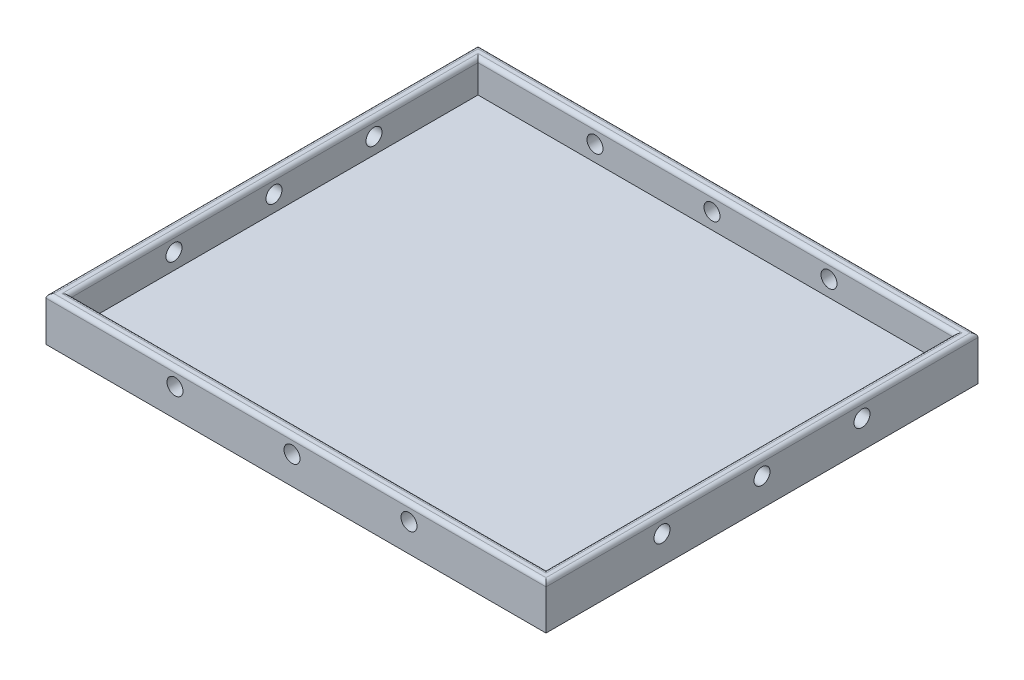
ISO-10303-21;
HEADER;
FILE_DESCRIPTION(('STEP AP214'),'2;1');
FILE_NAME('part.step','',(''),(''),'','','');
FILE_SCHEMA(('AUTOMOTIVE_DESIGN { 1 0 10303 214 1 1 1 1 }'));
ENDSEC;
DATA;
#1=APPLICATION_CONTEXT('core data for automotive mechanical design processes');
#2=APPLICATION_PROTOCOL_DEFINITION('international standard','automotive_design',2000,#1);
#3=PRODUCT_CONTEXT('',#1,'mechanical');
#4=PRODUCT('Part','Part','',(#3));
#5=PRODUCT_RELATED_PRODUCT_CATEGORY('part','',(#4));
#6=PRODUCT_DEFINITION_FORMATION('','',#4);
#7=PRODUCT_DEFINITION_CONTEXT('part definition',#1,'design');
#8=PRODUCT_DEFINITION('design','',#6,#7);
#9=PRODUCT_DEFINITION_SHAPE('','',#8);
#10=(LENGTH_UNIT() NAMED_UNIT(*) SI_UNIT(.MILLI.,.METRE.));
#11=(NAMED_UNIT(*) PLANE_ANGLE_UNIT() SI_UNIT($,.RADIAN.));
#12=(NAMED_UNIT(*) SI_UNIT($,.STERADIAN.) SOLID_ANGLE_UNIT());
#13=UNCERTAINTY_MEASURE_WITH_UNIT(LENGTH_MEASURE(1.E-05),#10,'distance_accuracy_value','');
#14=(GEOMETRIC_REPRESENTATION_CONTEXT(3) GLOBAL_UNCERTAINTY_ASSIGNED_CONTEXT((#13)) GLOBAL_UNIT_ASSIGNED_CONTEXT((#10,
#11,#12)) REPRESENTATION_CONTEXT('',''));
#15=CARTESIAN_POINT('',(0.,0.,0.));
#16=DIRECTION('',(0.,0.,1.));
#17=DIRECTION('',(1.,0.,0.));
#18=AXIS2_PLACEMENT_3D('',#15,#16,#17);
#19=CARTESIAN_POINT('',(-201.609907120743,11.,-77.8947368421052));
#20=DIRECTION('',(1.,0.,0.));
#21=DIRECTION('',(0.,0.,-1.));
#22=AXIS2_PLACEMENT_3D('',#19,#20,#21);
#23=PLANE('',#22);
#24=CARTESIAN_POINT('',(-201.609907120743,6.99999995326219,1.10526315789476));
#25=DIRECTION('',(1.,0.,0.));
#26=DIRECTION('',(0.,0.,-1.));
#27=AXIS2_PLACEMENT_3D('',#24,#25,#26);
#28=CIRCLE('',#27,2.);
#29=CARTESIAN_POINT('',(-201.609907120743,6.99999995326219,-0.894736842105239));
#30=VERTEX_POINT('',#29);
#31=EDGE_CURVE('E190',#30,#30,#28,.T.);
#32=ORIENTED_EDGE('',*,*,#31,.T.);
#33=EDGE_LOOP('',(#32));
#34=FACE_BOUND('',#33,.T.);
#35=CARTESIAN_POINT('',(-201.609907120743,6.99999997663109,-23.8947368421052));
#36=DIRECTION('',(1.,0.,0.));
#37=DIRECTION('',(0.,0.,-1.));
#38=AXIS2_PLACEMENT_3D('',#35,#36,#37);
#39=CIRCLE('',#38,2.);
#40=CARTESIAN_POINT('',(-201.609907120743,6.99999997663109,-25.8947368421052));
#41=VERTEX_POINT('',#40);
#42=EDGE_CURVE('E593',#41,#41,#39,.T.);
#43=ORIENTED_EDGE('',*,*,#42,.T.);
#44=EDGE_LOOP('',(#43));
#45=FACE_BOUND('',#44,.T.);
#46=CARTESIAN_POINT('',(-201.609907120743,7.,-48.8947368421052));
#47=DIRECTION('',(1.,0.,0.));
#48=DIRECTION('',(0.,0.,-1.));
#49=AXIS2_PLACEMENT_3D('',#46,#47,#48);
#50=CIRCLE('',#49,2.);
#51=CARTESIAN_POINT('',(-201.609907120743,7.,-50.8947368421052));
#52=VERTEX_POINT('',#51);
#53=EDGE_CURVE('E586',#52,#52,#50,.T.);
#54=ORIENTED_EDGE('',*,*,#53,.T.);
#55=EDGE_LOOP('',(#54));
#56=FACE_BOUND('',#55,.T.);
#57=DIRECTION('',(0.,-1.,0.));
#58=VECTOR('',#57,1.);
#59=CARTESIAN_POINT('',(-201.609907120743,11.,30.1052631578948));
#60=LINE('',#59,#58);
#61=CARTESIAN_POINT('',(-201.609907120743,10.,30.1052631578948));
#62=VERTEX_POINT('',#61);
#63=CARTESIAN_POINT('',(-201.609907120743,0.,30.1052631578948));
#64=VERTEX_POINT('',#63);
#65=EDGE_CURVE('E183',#62,#64,#60,.T.);
#66=ORIENTED_EDGE('',*,*,#65,.F.);
#67=DIRECTION('',(0.,0.,1.));
#68=VECTOR('',#67,1.);
#69=CARTESIAN_POINT('',(-201.609907120743,10.,-77.8947368421052));
#70=LINE('',#69,#68);
#71=CARTESIAN_POINT('',(-201.609907120743,10.,-77.8947368421052));
#72=VERTEX_POINT('',#71);
#73=EDGE_CURVE('E44',#62,#72,#70,.F.);
#74=ORIENTED_EDGE('',*,*,#73,.T.);
#75=DIRECTION('',(0.,-1.,0.));
#76=VECTOR('',#75,1.);
#77=CARTESIAN_POINT('',(-201.609907120743,11.,-77.8947368421052));
#78=LINE('',#77,#76);
#79=CARTESIAN_POINT('',(-201.609907120743,0.,-77.8947368421052));
#80=VERTEX_POINT('',#79);
#81=EDGE_CURVE('E177',#72,#80,#78,.T.);
#82=ORIENTED_EDGE('',*,*,#81,.T.);
#83=DIRECTION('',(0.,0.,1.));
#84=VECTOR('',#83,1.);
#85=CARTESIAN_POINT('',(-201.609907120743,0.,-77.8947368421052));
#86=LINE('',#85,#84);
#87=EDGE_CURVE('E162',#80,#64,#86,.T.);
#88=ORIENTED_EDGE('',*,*,#87,.T.);
#89=EDGE_LOOP('',(#66,#74,#82,#88));
#90=FACE_BOUND('',#89,.T.);
#91=ADVANCED_FACE('F35',(#34,#45,#56,#90),#23,.F.);
#92=CARTESIAN_POINT('',(-201.609907120743,11.,30.1052631578948));
#93=DIRECTION('',(0.,0.,-1.));
#94=DIRECTION('',(-1.,0.,0.));
#95=AXIS2_PLACEMENT_3D('',#92,#93,#94);
#96=PLANE('',#95);
#97=CARTESIAN_POINT('',(-169.359907120743,7.,30.1052631578948));
#98=DIRECTION('',(0.,0.,1.));
#99=DIRECTION('',(1.,0.,0.));
#100=AXIS2_PLACEMENT_3D('',#97,#98,#99);
#101=CIRCLE('',#100,2.);
#102=CARTESIAN_POINT('',(-167.359907120743,7.,30.1052631578948));
#103=VERTEX_POINT('',#102);
#104=EDGE_CURVE('E621',#103,#103,#101,.T.);
#105=ORIENTED_EDGE('',*,*,#104,.F.);
#106=EDGE_LOOP('',(#105));
#107=FACE_BOUND('',#106,.T.);
#108=CARTESIAN_POINT('',(-140.109907120743,7.,30.1052631578948));
#109=DIRECTION('',(0.,0.,1.));
#110=DIRECTION('',(1.,0.,0.));
#111=AXIS2_PLACEMENT_3D('',#108,#109,#110);
#112=CIRCLE('',#111,2.);
#113=CARTESIAN_POINT('',(-138.109907120743,7.,30.1052631578948));
#114=VERTEX_POINT('',#113);
#115=EDGE_CURVE('E615',#114,#114,#112,.T.);
#116=ORIENTED_EDGE('',*,*,#115,.F.);
#117=EDGE_LOOP('',(#116));
#118=FACE_BOUND('',#117,.T.);
#119=CARTESIAN_POINT('',(-110.859907120743,7.,30.1052631578948));
#120=DIRECTION('',(0.,0.,1.));
#121=DIRECTION('',(1.,0.,0.));
#122=AXIS2_PLACEMENT_3D('',#119,#120,#121);
#123=CIRCLE('',#122,2.);
#124=CARTESIAN_POINT('',(-108.859907120743,7.,30.1052631578948));
#125=VERTEX_POINT('',#124);
#126=EDGE_CURVE('E249',#125,#125,#123,.T.);
#127=ORIENTED_EDGE('',*,*,#126,.F.);
#128=EDGE_LOOP('',(#127));
#129=FACE_BOUND('',#128,.T.);
#130=DIRECTION('',(0.,-1.,0.));
#131=VECTOR('',#130,1.);
#132=CARTESIAN_POINT('',(-76.6099071207431,11.,30.1052631578948));
#133=LINE('',#132,#131);
#134=CARTESIAN_POINT('',(-76.6099071207431,10.,30.1052631578948));
#135=VERTEX_POINT('',#134);
#136=CARTESIAN_POINT('',(-76.6099071207431,0.,30.1052631578948));
#137=VERTEX_POINT('',#136);
#138=EDGE_CURVE('E181',#135,#137,#133,.T.);
#139=ORIENTED_EDGE('',*,*,#138,.F.);
#140=DIRECTION('',(1.,0.,0.));
#141=VECTOR('',#140,1.);
#142=CARTESIAN_POINT('',(-201.609907120743,10.,30.1052631578948));
#143=LINE('',#142,#141);
#144=EDGE_CURVE('E229',#135,#62,#143,.F.);
#145=ORIENTED_EDGE('',*,*,#144,.T.);
#146=ORIENTED_EDGE('',*,*,#65,.T.);
#147=DIRECTION('',(1.,0.,0.));
#148=VECTOR('',#147,1.);
#149=CARTESIAN_POINT('',(-201.609907120743,0.,30.1052631578948));
#150=LINE('',#149,#148);
#151=EDGE_CURVE('E168',#64,#137,#150,.T.);
#152=ORIENTED_EDGE('',*,*,#151,.T.);
#153=EDGE_LOOP('',(#139,#145,#146,#152));
#154=FACE_BOUND('',#153,.T.);
#155=ADVANCED_FACE('F281',(#107,#118,#129,#154),#96,.F.);
#156=CARTESIAN_POINT('',(-76.6099071207431,11.,-77.8947368421052));
#157=DIRECTION('',(-1.,0.,0.));
#158=DIRECTION('',(0.,0.,1.));
#159=AXIS2_PLACEMENT_3D('',#156,#157,#158);
#160=PLANE('',#159);
#161=CARTESIAN_POINT('',(-76.6099071207431,6.99999995326219,1.10526315789476));
#162=DIRECTION('',(1.,0.,0.));
#163=DIRECTION('',(0.,0.,-1.));
#164=AXIS2_PLACEMENT_3D('',#161,#162,#163);
#165=CIRCLE('',#164,2.);
#166=CARTESIAN_POINT('',(-76.6099071207431,6.99999995326219,-0.894736842105239));
#167=VERTEX_POINT('',#166);
#168=EDGE_CURVE('E578',#167,#167,#165,.T.);
#169=ORIENTED_EDGE('',*,*,#168,.F.);
#170=EDGE_LOOP('',(#169));
#171=FACE_BOUND('',#170,.T.);
#172=CARTESIAN_POINT('',(-76.6099071207431,6.99999997663109,-23.8947368421052));
#173=DIRECTION('',(1.,0.,0.));
#174=DIRECTION('',(0.,0.,-1.));
#175=AXIS2_PLACEMENT_3D('',#172,#173,#174);
#176=CIRCLE('',#175,2.);
#177=CARTESIAN_POINT('',(-76.6099071207431,6.99999997663109,-25.8947368421052));
#178=VERTEX_POINT('',#177);
#179=EDGE_CURVE('E582',#178,#178,#176,.T.);
#180=ORIENTED_EDGE('',*,*,#179,.F.);
#181=EDGE_LOOP('',(#180));
#182=FACE_BOUND('',#181,.T.);
#183=CARTESIAN_POINT('',(-76.6099071207431,7.,-48.8947368421052));
#184=DIRECTION('',(1.,0.,0.));
#185=DIRECTION('',(0.,0.,-1.));
#186=AXIS2_PLACEMENT_3D('',#183,#184,#185);
#187=CIRCLE('',#186,2.);
#188=CARTESIAN_POINT('',(-76.6099071207431,7.,-50.8947368421052));
#189=VERTEX_POINT('',#188);
#190=EDGE_CURVE('E585',#189,#189,#187,.T.);
#191=ORIENTED_EDGE('',*,*,#190,.F.);
#192=EDGE_LOOP('',(#191));
#193=FACE_BOUND('',#192,.T.);
#194=DIRECTION('',(0.,-1.,0.));
#195=VECTOR('',#194,1.);
#196=CARTESIAN_POINT('',(-76.6099071207431,11.,-77.8947368421052));
#197=LINE('',#196,#195);
#198=CARTESIAN_POINT('',(-76.6099071207431,10.,-77.8947368421052));
#199=VERTEX_POINT('',#198);
#200=CARTESIAN_POINT('',(-76.6099071207431,0.,-77.8947368421052));
#201=VERTEX_POINT('',#200);
#202=EDGE_CURVE('E179',#199,#201,#197,.T.);
#203=ORIENTED_EDGE('',*,*,#202,.F.);
#204=DIRECTION('',(0.,0.,-1.));
#205=VECTOR('',#204,1.);
#206=CARTESIAN_POINT('',(-76.6099071207431,10.,30.1052631578948));
#207=LINE('',#206,#205);
#208=EDGE_CURVE('E232',#199,#135,#207,.F.);
#209=ORIENTED_EDGE('',*,*,#208,.T.);
#210=ORIENTED_EDGE('',*,*,#138,.T.);
#211=DIRECTION('',(0.,0.,-1.));
#212=VECTOR('',#211,1.);
#213=CARTESIAN_POINT('',(-76.6099071207431,0.,-77.8947368421052));
#214=LINE('',#213,#212);
#215=EDGE_CURVE('E171',#137,#201,#214,.T.);
#216=ORIENTED_EDGE('',*,*,#215,.T.);
#217=EDGE_LOOP('',(#203,#209,#210,#216));
#218=FACE_BOUND('',#217,.T.);
#219=ADVANCED_FACE('F272',(#171,#182,#193,#218),#160,.F.);
#220=CARTESIAN_POINT('',(-201.609907120743,11.,-77.8947368421052));
#221=DIRECTION('',(0.,0.,1.));
#222=DIRECTION('',(1.,0.,0.));
#223=AXIS2_PLACEMENT_3D('',#220,#221,#222);
#224=PLANE('',#223);
#225=CARTESIAN_POINT('',(-169.359907120743,7.,-77.8947368421052));
#226=DIRECTION('',(0.,0.,1.));
#227=DIRECTION('',(1.,0.,0.));
#228=AXIS2_PLACEMENT_3D('',#225,#226,#227);
#229=CIRCLE('',#228,2.);
#230=CARTESIAN_POINT('',(-167.359907120743,7.,-77.8947368421052));
#231=VERTEX_POINT('',#230);
#232=EDGE_CURVE('E201',#231,#231,#229,.T.);
#233=ORIENTED_EDGE('',*,*,#232,.T.);
#234=EDGE_LOOP('',(#233));
#235=FACE_BOUND('',#234,.T.);
#236=CARTESIAN_POINT('',(-140.109907120743,7.,-77.8947368421052));
#237=DIRECTION('',(0.,0.,1.));
#238=DIRECTION('',(1.,0.,0.));
#239=AXIS2_PLACEMENT_3D('',#236,#237,#238);
#240=CIRCLE('',#239,2.);
#241=CARTESIAN_POINT('',(-138.109907120743,7.,-77.8947368421052));
#242=VERTEX_POINT('',#241);
#243=EDGE_CURVE('E618',#242,#242,#240,.T.);
#244=ORIENTED_EDGE('',*,*,#243,.T.);
#245=EDGE_LOOP('',(#244));
#246=FACE_BOUND('',#245,.T.);
#247=CARTESIAN_POINT('',(-110.859907120743,7.,-77.8947368421052));
#248=DIRECTION('',(0.,0.,1.));
#249=DIRECTION('',(1.,0.,0.));
#250=AXIS2_PLACEMENT_3D('',#247,#248,#249);
#251=CIRCLE('',#250,2.);
#252=CARTESIAN_POINT('',(-108.859907120743,7.,-77.8947368421052));
#253=VERTEX_POINT('',#252);
#254=EDGE_CURVE('E612',#253,#253,#251,.T.);
#255=ORIENTED_EDGE('',*,*,#254,.T.);
#256=EDGE_LOOP('',(#255));
#257=FACE_BOUND('',#256,.T.);
#258=ORIENTED_EDGE('',*,*,#81,.F.);
#259=DIRECTION('',(-1.,0.,0.));
#260=VECTOR('',#259,1.);
#261=CARTESIAN_POINT('',(-76.6099071207431,10.,-77.8947368421052));
#262=LINE('',#261,#260);
#263=EDGE_CURVE('E11',#72,#199,#262,.F.);
#264=ORIENTED_EDGE('',*,*,#263,.T.);
#265=ORIENTED_EDGE('',*,*,#202,.T.);
#266=DIRECTION('',(-1.,0.,0.));
#267=VECTOR('',#266,1.);
#268=CARTESIAN_POINT('',(-201.609907120743,0.,-77.8947368421052));
#269=LINE('',#268,#267);
#270=EDGE_CURVE('E174',#201,#80,#269,.T.);
#271=ORIENTED_EDGE('',*,*,#270,.T.);
#272=EDGE_LOOP('',(#258,#264,#265,#271));
#273=FACE_BOUND('',#272,.T.);
#274=ADVANCED_FACE('F270',(#235,#246,#257,#273),#224,.F.);
#275=CARTESIAN_POINT('',(0.,11.,0.));
#276=DIRECTION('',(0.,1.,0.));
#277=DIRECTION('',(0.,0.,1.));
#278=AXIS2_PLACEMENT_3D('',#275,#276,#277);
#279=PLANE('',#278);
#280=DIRECTION('',(0.,0.,-1.));
#281=VECTOR('',#280,1.);
#282=CARTESIAN_POINT('',(-78.6099071207431,11.,27.1052631578948));
#283=LINE('',#282,#281);
#284=CARTESIAN_POINT('',(-78.6099071207431,11.,-75.8947368421052));
#285=VERTEX_POINT('',#284);
#286=CARTESIAN_POINT('',(-78.6099071207431,11.,28.1052631578948));
#287=VERTEX_POINT('',#286);
#288=EDGE_CURVE('E224',#285,#287,#283,.F.);
#289=ORIENTED_EDGE('',*,*,#288,.T.);
#290=DIRECTION('',(1.,0.,0.));
#291=VECTOR('',#290,1.);
#292=CARTESIAN_POINT('',(-198.609907120743,11.,28.1052631578948));
#293=LINE('',#292,#291);
#294=CARTESIAN_POINT('',(-199.609907120743,11.,28.1052631578948));
#295=VERTEX_POINT('',#294);
#296=EDGE_CURVE('E226',#287,#295,#293,.F.);
#297=ORIENTED_EDGE('',*,*,#296,.T.);
#298=DIRECTION('',(0.,0.,1.));
#299=VECTOR('',#298,1.);
#300=CARTESIAN_POINT('',(-199.609907120743,11.,-74.8947368421052));
#301=LINE('',#300,#299);
#302=CARTESIAN_POINT('',(-199.609907120743,11.,-75.8947368421052));
#303=VERTEX_POINT('',#302);
#304=EDGE_CURVE('E222',#295,#303,#301,.F.);
#305=ORIENTED_EDGE('',*,*,#304,.T.);
#306=DIRECTION('',(-1.,0.,0.));
#307=VECTOR('',#306,1.);
#308=CARTESIAN_POINT('',(-79.6099071207431,11.,-75.8947368421052));
#309=LINE('',#308,#307);
#310=EDGE_CURVE('E220',#303,#285,#309,.F.);
#311=ORIENTED_EDGE('',*,*,#310,.T.);
#312=EDGE_LOOP('',(#289,#297,#305,#311));
#313=FACE_BOUND('',#312,.T.);
#314=DIRECTION('',(0.,0.,1.));
#315=VECTOR('',#314,1.);
#316=CARTESIAN_POINT('',(-200.609907120743,11.,30.1052631578948));
#317=LINE('',#316,#315);
#318=CARTESIAN_POINT('',(-200.609907120743,11.,-76.8947368421052));
#319=VERTEX_POINT('',#318);
#320=CARTESIAN_POINT('',(-200.609907120743,11.,29.1052631578948));
#321=VERTEX_POINT('',#320);
#322=EDGE_CURVE('E213',#319,#321,#317,.T.);
#323=ORIENTED_EDGE('',*,*,#322,.T.);
#324=DIRECTION('',(1.,0.,0.));
#325=VECTOR('',#324,1.);
#326=CARTESIAN_POINT('',(-76.6099071207431,11.,29.1052631578948));
#327=LINE('',#326,#325);
#328=CARTESIAN_POINT('',(-77.6099071207431,11.,29.1052631578948));
#329=VERTEX_POINT('',#328);
#330=EDGE_CURVE('E217',#321,#329,#327,.T.);
#331=ORIENTED_EDGE('',*,*,#330,.T.);
#332=DIRECTION('',(0.,0.,-1.));
#333=VECTOR('',#332,1.);
#334=CARTESIAN_POINT('',(-77.6099071207431,11.,-77.8947368421052));
#335=LINE('',#334,#333);
#336=CARTESIAN_POINT('',(-77.6099071207431,11.,-76.8947368421052));
#337=VERTEX_POINT('',#336);
#338=EDGE_CURVE('E215',#329,#337,#335,.T.);
#339=ORIENTED_EDGE('',*,*,#338,.T.);
#340=DIRECTION('',(-1.,0.,0.));
#341=VECTOR('',#340,1.);
#342=CARTESIAN_POINT('',(-201.609907120743,11.,-76.8947368421052));
#343=LINE('',#342,#341);
#344=EDGE_CURVE('E211',#337,#319,#343,.T.);
#345=ORIENTED_EDGE('',*,*,#344,.T.);
#346=EDGE_LOOP('',(#323,#331,#339,#345));
#347=FACE_BOUND('',#346,.T.);
#348=ADVANCED_FACE('F289',(#313,#347),#279,.T.);
#349=CARTESIAN_POINT('',(0.,0.,0.));
#350=DIRECTION('',(0.,1.,0.));
#351=DIRECTION('',(0.,0.,1.));
#352=AXIS2_PLACEMENT_3D('',#349,#350,#351);
#353=PLANE('',#352);
#354=ORIENTED_EDGE('',*,*,#87,.F.);
#355=ORIENTED_EDGE('',*,*,#270,.F.);
#356=ORIENTED_EDGE('',*,*,#215,.F.);
#357=ORIENTED_EDGE('',*,*,#151,.F.);
#358=EDGE_LOOP('',(#354,#355,#356,#357));
#359=FACE_BOUND('',#358,.T.);
#360=ADVANCED_FACE('F279',(#359),#353,.F.);
#361=CARTESIAN_POINT('',(-198.609907120743,3.,-74.8947368421052));
#362=DIRECTION('',(-1.,0.,0.));
#363=DIRECTION('',(0.,0.,1.));
#364=AXIS2_PLACEMENT_3D('',#361,#362,#363);
#365=PLANE('',#364);
#366=CARTESIAN_POINT('',(-198.609907120743,6.99999995326219,1.10526315789476));
#367=DIRECTION('',(-1.,0.,0.));
#368=DIRECTION('',(0.,0.,1.));
#369=AXIS2_PLACEMENT_3D('',#366,#367,#368);
#370=CIRCLE('',#369,2.);
#371=CARTESIAN_POINT('',(-198.609907120743,6.99999995326219,3.10526315789476));
#372=VERTEX_POINT('',#371);
#373=EDGE_CURVE('E151',#372,#372,#370,.T.);
#374=ORIENTED_EDGE('',*,*,#373,.T.);
#375=EDGE_LOOP('',(#374));
#376=FACE_BOUND('',#375,.T.);
#377=CARTESIAN_POINT('',(-198.609907120743,6.99999997663109,-23.8947368421052));
#378=DIRECTION('',(-1.,0.,0.));
#379=DIRECTION('',(0.,0.,1.));
#380=AXIS2_PLACEMENT_3D('',#377,#378,#379);
#381=CIRCLE('',#380,2.);
#382=CARTESIAN_POINT('',(-198.609907120743,6.99999997663109,-21.8947368421052));
#383=VERTEX_POINT('',#382);
#384=EDGE_CURVE('E194',#383,#383,#381,.T.);
#385=ORIENTED_EDGE('',*,*,#384,.T.);
#386=EDGE_LOOP('',(#385));
#387=FACE_BOUND('',#386,.T.);
#388=CARTESIAN_POINT('',(-198.609907120743,7.,-48.8947368421052));
#389=DIRECTION('',(-1.,0.,0.));
#390=DIRECTION('',(0.,0.,1.));
#391=AXIS2_PLACEMENT_3D('',#388,#389,#390);
#392=CIRCLE('',#391,2.);
#393=CARTESIAN_POINT('',(-198.609907120743,7.,-46.8947368421052));
#394=VERTEX_POINT('',#393);
#395=EDGE_CURVE('E189',#394,#394,#392,.T.);
#396=ORIENTED_EDGE('',*,*,#395,.T.);
#397=EDGE_LOOP('',(#396));
#398=FACE_BOUND('',#397,.T.);
#399=DIRECTION('',(0.,1.,0.));
#400=VECTOR('',#399,1.);
#401=CARTESIAN_POINT('',(-198.609907120743,3.,-74.8947368421052));
#402=LINE('',#401,#400);
#403=CARTESIAN_POINT('',(-198.609907120743,3.,-74.8947368421052));
#404=VERTEX_POINT('',#403);
#405=CARTESIAN_POINT('',(-198.609907120743,10.,-74.8947368421052));
#406=VERTEX_POINT('',#405);
#407=EDGE_CURVE('E160',#404,#406,#402,.T.);
#408=ORIENTED_EDGE('',*,*,#407,.T.);
#409=DIRECTION('',(0.,0.,1.));
#410=VECTOR('',#409,1.);
#411=CARTESIAN_POINT('',(-198.609907120743,10.,27.1052631578948));
#412=LINE('',#411,#410);
#413=CARTESIAN_POINT('',(-198.609907120743,10.,27.1052631578948));
#414=VERTEX_POINT('',#413);
#415=EDGE_CURVE('E133',#406,#414,#412,.T.);
#416=ORIENTED_EDGE('',*,*,#415,.T.);
#417=DIRECTION('',(0.,1.,0.));
#418=VECTOR('',#417,1.);
#419=CARTESIAN_POINT('',(-198.609907120743,3.,27.1052631578948));
#420=LINE('',#419,#418);
#421=CARTESIAN_POINT('',(-198.609907120743,3.,27.1052631578948));
#422=VERTEX_POINT('',#421);
#423=EDGE_CURVE('E126',#422,#414,#420,.T.);
#424=ORIENTED_EDGE('',*,*,#423,.F.);
#425=DIRECTION('',(0.,0.,1.));
#426=VECTOR('',#425,1.);
#427=CARTESIAN_POINT('',(-198.609907120743,3.,-74.8947368421052));
#428=LINE('',#427,#426);
#429=EDGE_CURVE('E130',#404,#422,#428,.T.);
#430=ORIENTED_EDGE('',*,*,#429,.F.);
#431=EDGE_LOOP('',(#408,#416,#424,#430));
#432=FACE_BOUND('',#431,.T.);
#433=ADVANCED_FACE('F128',(#376,#387,#398,#432),#365,.F.);
#434=CARTESIAN_POINT('',(-198.609907120743,3.,-74.8947368421052));
#435=DIRECTION('',(0.,0.,-1.));
#436=DIRECTION('',(-1.,0.,0.));
#437=AXIS2_PLACEMENT_3D('',#434,#435,#436);
#438=PLANE('',#437);
#439=CARTESIAN_POINT('',(-169.359907120743,7.,-74.8947368421052));
#440=DIRECTION('',(0.,0.,-1.));
#441=DIRECTION('',(-1.,0.,0.));
#442=AXIS2_PLACEMENT_3D('',#439,#440,#441);
#443=CIRCLE('',#442,2.);
#444=CARTESIAN_POINT('',(-171.359907120743,7.,-74.8947368421052));
#445=VERTEX_POINT('',#444);
#446=EDGE_CURVE('E209',#445,#445,#443,.T.);
#447=ORIENTED_EDGE('',*,*,#446,.T.);
#448=EDGE_LOOP('',(#447));
#449=FACE_BOUND('',#448,.T.);
#450=CARTESIAN_POINT('',(-140.109907120743,7.,-74.8947368421052));
#451=DIRECTION('',(0.,0.,-1.));
#452=DIRECTION('',(-1.,0.,0.));
#453=AXIS2_PLACEMENT_3D('',#450,#451,#452);
#454=CIRCLE('',#453,2.);
#455=CARTESIAN_POINT('',(-142.109907120743,7.,-74.8947368421052));
#456=VERTEX_POINT('',#455);
#457=EDGE_CURVE('E205',#456,#456,#454,.T.);
#458=ORIENTED_EDGE('',*,*,#457,.T.);
#459=EDGE_LOOP('',(#458));
#460=FACE_BOUND('',#459,.T.);
#461=CARTESIAN_POINT('',(-110.859907120743,7.,-74.8947368421052));
#462=DIRECTION('',(0.,0.,-1.));
#463=DIRECTION('',(-1.,0.,0.));
#464=AXIS2_PLACEMENT_3D('',#461,#462,#463);
#465=CIRCLE('',#464,2.);
#466=CARTESIAN_POINT('',(-112.859907120743,7.,-74.8947368421052));
#467=VERTEX_POINT('',#466);
#468=EDGE_CURVE('E200',#467,#467,#465,.T.);
#469=ORIENTED_EDGE('',*,*,#468,.T.);
#470=EDGE_LOOP('',(#469));
#471=FACE_BOUND('',#470,.T.);
#472=DIRECTION('',(0.,1.,0.));
#473=VECTOR('',#472,1.);
#474=CARTESIAN_POINT('',(-79.6099071207431,3.,-74.8947368421052));
#475=LINE('',#474,#473);
#476=CARTESIAN_POINT('',(-79.6099071207431,3.,-74.8947368421052));
#477=VERTEX_POINT('',#476);
#478=CARTESIAN_POINT('',(-79.6099071207431,10.,-74.8947368421052));
#479=VERTEX_POINT('',#478);
#480=EDGE_CURVE('E163',#477,#479,#475,.T.);
#481=ORIENTED_EDGE('',*,*,#480,.T.);
#482=DIRECTION('',(-1.,0.,0.));
#483=VECTOR('',#482,1.);
#484=CARTESIAN_POINT('',(-198.609907120743,10.,-74.8947368421052));
#485=LINE('',#484,#483);
#486=EDGE_CURVE('E59',#479,#406,#485,.T.);
#487=ORIENTED_EDGE('',*,*,#486,.T.);
#488=ORIENTED_EDGE('',*,*,#407,.F.);
#489=DIRECTION('',(-1.,0.,0.));
#490=VECTOR('',#489,1.);
#491=CARTESIAN_POINT('',(-198.609907120743,3.,-74.8947368421052));
#492=LINE('',#491,#490);
#493=EDGE_CURVE('E138',#477,#404,#492,.T.);
#494=ORIENTED_EDGE('',*,*,#493,.F.);
#495=EDGE_LOOP('',(#481,#487,#488,#494));
#496=FACE_BOUND('',#495,.T.);
#497=ADVANCED_FACE('F465',(#449,#460,#471,#496),#438,.F.);
#498=CARTESIAN_POINT('',(-79.6099071207431,3.,-74.8947368421052));
#499=DIRECTION('',(1.,0.,0.));
#500=DIRECTION('',(0.,0.,-1.));
#501=AXIS2_PLACEMENT_3D('',#498,#499,#500);
#502=PLANE('',#501);
#503=CARTESIAN_POINT('',(-79.6099071207431,6.99999995326219,1.10526315789476));
#504=DIRECTION('',(1.,0.,0.));
#505=DIRECTION('',(0.,0.,-1.));
#506=AXIS2_PLACEMENT_3D('',#503,#504,#505);
#507=CIRCLE('',#506,2.);
#508=CARTESIAN_POINT('',(-79.6099071207431,6.99999995326219,-0.894736842105239));
#509=VERTEX_POINT('',#508);
#510=EDGE_CURVE('E154',#509,#509,#507,.T.);
#511=ORIENTED_EDGE('',*,*,#510,.T.);
#512=EDGE_LOOP('',(#511));
#513=FACE_BOUND('',#512,.T.);
#514=CARTESIAN_POINT('',(-79.6099071207431,6.99999997663109,-23.8947368421052));
#515=DIRECTION('',(1.,0.,0.));
#516=DIRECTION('',(0.,0.,-1.));
#517=AXIS2_PLACEMENT_3D('',#514,#515,#516);
#518=CIRCLE('',#517,2.);
#519=CARTESIAN_POINT('',(-79.6099071207431,6.99999997663109,-25.8947368421052));
#520=VERTEX_POINT('',#519);
#521=EDGE_CURVE('E191',#520,#520,#518,.T.);
#522=ORIENTED_EDGE('',*,*,#521,.T.);
#523=EDGE_LOOP('',(#522));
#524=FACE_BOUND('',#523,.T.);
#525=CARTESIAN_POINT('',(-79.6099071207431,7.,-48.8947368421052));
#526=DIRECTION('',(1.,0.,0.));
#527=DIRECTION('',(0.,0.,-1.));
#528=AXIS2_PLACEMENT_3D('',#525,#526,#527);
#529=CIRCLE('',#528,2.);
#530=CARTESIAN_POINT('',(-79.6099071207431,7.,-50.8947368421052));
#531=VERTEX_POINT('',#530);
#532=EDGE_CURVE('E186',#531,#531,#529,.T.);
#533=ORIENTED_EDGE('',*,*,#532,.T.);
#534=EDGE_LOOP('',(#533));
#535=FACE_BOUND('',#534,.T.);
#536=DIRECTION('',(0.,1.,0.));
#537=VECTOR('',#536,1.);
#538=CARTESIAN_POINT('',(-79.6099071207431,3.,27.1052631578948));
#539=LINE('',#538,#537);
#540=CARTESIAN_POINT('',(-79.6099071207431,3.,27.1052631578948));
#541=VERTEX_POINT('',#540);
#542=CARTESIAN_POINT('',(-79.6099071207431,10.,27.1052631578948));
#543=VERTEX_POINT('',#542);
#544=EDGE_CURVE('E137',#541,#543,#539,.T.);
#545=ORIENTED_EDGE('',*,*,#544,.T.);
#546=DIRECTION('',(0.,0.,-1.));
#547=VECTOR('',#546,1.);
#548=CARTESIAN_POINT('',(-79.6099071207431,10.,-74.8947368421052));
#549=LINE('',#548,#547);
#550=EDGE_CURVE('E234',#543,#479,#549,.T.);
#551=ORIENTED_EDGE('',*,*,#550,.T.);
#552=ORIENTED_EDGE('',*,*,#480,.F.);
#553=DIRECTION('',(0.,0.,-1.));
#554=VECTOR('',#553,1.);
#555=CARTESIAN_POINT('',(-79.6099071207431,3.,-74.8947368421052));
#556=LINE('',#555,#554);
#557=EDGE_CURVE('E147',#541,#477,#556,.T.);
#558=ORIENTED_EDGE('',*,*,#557,.F.);
#559=EDGE_LOOP('',(#545,#551,#552,#558));
#560=FACE_BOUND('',#559,.T.);
#561=ADVANCED_FACE('F457',(#513,#524,#535,#560),#502,.F.);
#562=CARTESIAN_POINT('',(-198.609907120743,3.,27.1052631578948));
#563=DIRECTION('',(0.,0.,1.));
#564=DIRECTION('',(1.,0.,0.));
#565=AXIS2_PLACEMENT_3D('',#562,#563,#564);
#566=PLANE('',#565);
#567=CARTESIAN_POINT('',(-169.359907120743,7.,27.1052631578948));
#568=DIRECTION('',(0.,0.,1.));
#569=DIRECTION('',(1.,0.,0.));
#570=AXIS2_PLACEMENT_3D('',#567,#568,#569);
#571=CIRCLE('',#570,2.);
#572=CARTESIAN_POINT('',(-167.359907120743,7.,27.1052631578948));
#573=VERTEX_POINT('',#572);
#574=EDGE_CURVE('E206',#573,#573,#571,.T.);
#575=ORIENTED_EDGE('',*,*,#574,.T.);
#576=EDGE_LOOP('',(#575));
#577=FACE_BOUND('',#576,.T.);
#578=CARTESIAN_POINT('',(-140.109907120743,7.,27.1052631578948));
#579=DIRECTION('',(0.,0.,1.));
#580=DIRECTION('',(1.,0.,0.));
#581=AXIS2_PLACEMENT_3D('',#578,#579,#580);
#582=CIRCLE('',#581,2.);
#583=CARTESIAN_POINT('',(-138.109907120743,7.,27.1052631578948));
#584=VERTEX_POINT('',#583);
#585=EDGE_CURVE('E202',#584,#584,#582,.T.);
#586=ORIENTED_EDGE('',*,*,#585,.T.);
#587=EDGE_LOOP('',(#586));
#588=FACE_BOUND('',#587,.T.);
#589=CARTESIAN_POINT('',(-110.859907120743,7.,27.1052631578948));
#590=DIRECTION('',(0.,0.,1.));
#591=DIRECTION('',(1.,0.,0.));
#592=AXIS2_PLACEMENT_3D('',#589,#590,#591);
#593=CIRCLE('',#592,2.);
#594=CARTESIAN_POINT('',(-108.859907120743,7.,27.1052631578948));
#595=VERTEX_POINT('',#594);
#596=EDGE_CURVE('E197',#595,#595,#593,.T.);
#597=ORIENTED_EDGE('',*,*,#596,.T.);
#598=EDGE_LOOP('',(#597));
#599=FACE_BOUND('',#598,.T.);
#600=ORIENTED_EDGE('',*,*,#423,.T.);
#601=DIRECTION('',(1.,0.,0.));
#602=VECTOR('',#601,1.);
#603=CARTESIAN_POINT('',(-79.6099071207431,10.,27.1052631578948));
#604=LINE('',#603,#602);
#605=EDGE_CURVE('E185',#414,#543,#604,.T.);
#606=ORIENTED_EDGE('',*,*,#605,.T.);
#607=ORIENTED_EDGE('',*,*,#544,.F.);
#608=DIRECTION('',(1.,0.,0.));
#609=VECTOR('',#608,1.);
#610=CARTESIAN_POINT('',(-198.609907120743,3.,27.1052631578948));
#611=LINE('',#610,#609);
#612=EDGE_CURVE('E141',#422,#541,#611,.T.);
#613=ORIENTED_EDGE('',*,*,#612,.F.);
#614=EDGE_LOOP('',(#600,#606,#607,#613));
#615=FACE_BOUND('',#614,.T.);
#616=ADVANCED_FACE('F142',(#577,#588,#599,#615),#566,.F.);
#617=CARTESIAN_POINT('',(0.,3.,0.));
#618=DIRECTION('',(0.,1.,0.));
#619=DIRECTION('',(0.,0.,1.));
#620=AXIS2_PLACEMENT_3D('',#617,#618,#619);
#621=PLANE('',#620);
#622=ORIENTED_EDGE('',*,*,#429,.T.);
#623=ORIENTED_EDGE('',*,*,#612,.T.);
#624=ORIENTED_EDGE('',*,*,#557,.T.);
#625=ORIENTED_EDGE('',*,*,#493,.T.);
#626=EDGE_LOOP('',(#622,#623,#624,#625));
#627=FACE_BOUND('',#626,.T.);
#628=ADVANCED_FACE('F149',(#627),#621,.T.);
#629=CARTESIAN_POINT('',(-201.609907120743,7.,-48.8947368421052));
#630=DIRECTION('',(1.,0.,0.));
#631=DIRECTION('',(0.,0.,-1.));
#632=AXIS2_PLACEMENT_3D('',#629,#630,#631);
#633=CYLINDRICAL_SURFACE('',#632,2.);
#634=ORIENTED_EDGE('',*,*,#190,.T.);
#635=EDGE_LOOP('',(#634));
#636=FACE_BOUND('',#635,.T.);
#637=ORIENTED_EDGE('',*,*,#532,.F.);
#638=EDGE_LOOP('',(#637));
#639=FACE_BOUND('',#638,.T.);
#640=ADVANCED_FACE('F427',(#636,#639),#633,.F.);
#641=CARTESIAN_POINT('',(-201.609907120743,6.99999997663109,-23.8947368421052));
#642=DIRECTION('',(1.,0.,0.));
#643=DIRECTION('',(0.,0.,-1.));
#644=AXIS2_PLACEMENT_3D('',#641,#642,#643);
#645=CYLINDRICAL_SURFACE('',#644,2.);
#646=ORIENTED_EDGE('',*,*,#179,.T.);
#647=EDGE_LOOP('',(#646));
#648=FACE_BOUND('',#647,.T.);
#649=ORIENTED_EDGE('',*,*,#521,.F.);
#650=EDGE_LOOP('',(#649));
#651=FACE_BOUND('',#650,.T.);
#652=ADVANCED_FACE('F419',(#648,#651),#645,.F.);
#653=CARTESIAN_POINT('',(-201.609907120743,6.99999995326219,1.10526315789476));
#654=DIRECTION('',(1.,0.,0.));
#655=DIRECTION('',(0.,0.,-1.));
#656=AXIS2_PLACEMENT_3D('',#653,#654,#655);
#657=CYLINDRICAL_SURFACE('',#656,2.);
#658=ORIENTED_EDGE('',*,*,#168,.T.);
#659=EDGE_LOOP('',(#658));
#660=FACE_BOUND('',#659,.T.);
#661=ORIENTED_EDGE('',*,*,#510,.F.);
#662=EDGE_LOOP('',(#661));
#663=FACE_BOUND('',#662,.T.);
#664=ADVANCED_FACE('F410',(#660,#663),#657,.F.);
#665=ORIENTED_EDGE('',*,*,#53,.F.);
#666=EDGE_LOOP('',(#665));
#667=FACE_BOUND('',#666,.T.);
#668=ORIENTED_EDGE('',*,*,#395,.F.);
#669=EDGE_LOOP('',(#668));
#670=FACE_BOUND('',#669,.T.);
#671=ADVANCED_FACE('F416',(#667,#670),#633,.F.);
#672=ORIENTED_EDGE('',*,*,#42,.F.);
#673=EDGE_LOOP('',(#672));
#674=FACE_BOUND('',#673,.T.);
#675=ORIENTED_EDGE('',*,*,#384,.F.);
#676=EDGE_LOOP('',(#675));
#677=FACE_BOUND('',#676,.T.);
#678=ADVANCED_FACE('F407',(#674,#677),#645,.F.);
#679=ORIENTED_EDGE('',*,*,#31,.F.);
#680=EDGE_LOOP('',(#679));
#681=FACE_BOUND('',#680,.T.);
#682=ORIENTED_EDGE('',*,*,#373,.F.);
#683=EDGE_LOOP('',(#682));
#684=FACE_BOUND('',#683,.T.);
#685=ADVANCED_FACE('F400',(#681,#684),#657,.F.);
#686=CARTESIAN_POINT('',(-110.859907120743,7.,-77.8947368421052));
#687=DIRECTION('',(0.,0.,1.));
#688=DIRECTION('',(1.,0.,0.));
#689=AXIS2_PLACEMENT_3D('',#686,#687,#688);
#690=CYLINDRICAL_SURFACE('',#689,2.);
#691=ORIENTED_EDGE('',*,*,#126,.T.);
#692=EDGE_LOOP('',(#691));
#693=FACE_BOUND('',#692,.T.);
#694=ORIENTED_EDGE('',*,*,#596,.F.);
#695=EDGE_LOOP('',(#694));
#696=FACE_BOUND('',#695,.T.);
#697=ADVANCED_FACE('F382',(#693,#696),#690,.F.);
#698=CARTESIAN_POINT('',(-140.109907120743,7.,-77.8947368421052));
#699=DIRECTION('',(0.,0.,1.));
#700=DIRECTION('',(1.,0.,0.));
#701=AXIS2_PLACEMENT_3D('',#698,#699,#700);
#702=CYLINDRICAL_SURFACE('',#701,2.);
#703=ORIENTED_EDGE('',*,*,#115,.T.);
#704=EDGE_LOOP('',(#703));
#705=FACE_BOUND('',#704,.T.);
#706=ORIENTED_EDGE('',*,*,#585,.F.);
#707=EDGE_LOOP('',(#706));
#708=FACE_BOUND('',#707,.T.);
#709=ADVANCED_FACE('F374',(#705,#708),#702,.F.);
#710=CARTESIAN_POINT('',(-169.359907120743,7.,-77.8947368421052));
#711=DIRECTION('',(0.,0.,1.));
#712=DIRECTION('',(1.,0.,0.));
#713=AXIS2_PLACEMENT_3D('',#710,#711,#712);
#714=CYLINDRICAL_SURFACE('',#713,2.);
#715=ORIENTED_EDGE('',*,*,#104,.T.);
#716=EDGE_LOOP('',(#715));
#717=FACE_BOUND('',#716,.T.);
#718=ORIENTED_EDGE('',*,*,#574,.F.);
#719=EDGE_LOOP('',(#718));
#720=FACE_BOUND('',#719,.T.);
#721=ADVANCED_FACE('F365',(#717,#720),#714,.F.);
#722=ORIENTED_EDGE('',*,*,#254,.F.);
#723=EDGE_LOOP('',(#722));
#724=FACE_BOUND('',#723,.T.);
#725=ORIENTED_EDGE('',*,*,#468,.F.);
#726=EDGE_LOOP('',(#725));
#727=FACE_BOUND('',#726,.T.);
#728=ADVANCED_FACE('F371',(#724,#727),#690,.F.);
#729=ORIENTED_EDGE('',*,*,#243,.F.);
#730=EDGE_LOOP('',(#729));
#731=FACE_BOUND('',#730,.T.);
#732=ORIENTED_EDGE('',*,*,#457,.F.);
#733=EDGE_LOOP('',(#732));
#734=FACE_BOUND('',#733,.T.);
#735=ADVANCED_FACE('F362',(#731,#734),#702,.F.);
#736=ORIENTED_EDGE('',*,*,#232,.F.);
#737=EDGE_LOOP('',(#736));
#738=FACE_BOUND('',#737,.T.);
#739=ORIENTED_EDGE('',*,*,#446,.F.);
#740=EDGE_LOOP('',(#739));
#741=FACE_BOUND('',#740,.T.);
#742=ADVANCED_FACE('F328',(#738,#741),#714,.F.);
#743=CARTESIAN_POINT('',(-198.609907120743,10.,-75.8947368421052));
#744=DIRECTION('',(1.,0.,0.));
#745=DIRECTION('',(0.,0.,-1.));
#746=AXIS2_PLACEMENT_3D('',#743,#744,#745);
#747=CYLINDRICAL_SURFACE('',#746,1.);
#748=CARTESIAN_POINT('',(-78.6099071207431,10.,-75.8947368421052));
#749=DIRECTION('',(0.707106781186548,0.,0.707106781186547));
#750=DIRECTION('',(-0.707106781186547,0.,0.707106781186548));
#751=AXIS2_PLACEMENT_3D('',#748,#749,#750);
#752=ELLIPSE('',#751,1.41421356237309,1.);
#753=EDGE_CURVE('E243',#285,#479,#752,.T.);
#754=ORIENTED_EDGE('',*,*,#753,.F.);
#755=ORIENTED_EDGE('',*,*,#310,.F.);
#756=CARTESIAN_POINT('',(-199.609907120743,10.,-75.8947368421052));
#757=DIRECTION('',(0.707106781186547,0.,-0.707106781186547));
#758=DIRECTION('',(-0.707106781186547,0.,-0.707106781186547));
#759=AXIS2_PLACEMENT_3D('',#756,#757,#758);
#760=ELLIPSE('',#759,1.41421356237309,1.);
#761=EDGE_CURVE('E246',#406,#303,#760,.F.);
#762=ORIENTED_EDGE('',*,*,#761,.F.);
#763=ORIENTED_EDGE('',*,*,#486,.F.);
#764=EDGE_LOOP('',(#754,#755,#762,#763));
#765=FACE_BOUND('',#764,.T.);
#766=ADVANCED_FACE('F324',(#765),#747,.T.);
#767=CARTESIAN_POINT('',(-199.609907120743,10.,-74.8947368421052));
#768=DIRECTION('',(0.,0.,-1.));
#769=DIRECTION('',(-1.,0.,0.));
#770=AXIS2_PLACEMENT_3D('',#767,#768,#769);
#771=CYLINDRICAL_SURFACE('',#770,1.);
#772=ORIENTED_EDGE('',*,*,#761,.T.);
#773=ORIENTED_EDGE('',*,*,#304,.F.);
#774=CARTESIAN_POINT('',(-199.609907120743,10.,28.1052631578948));
#775=DIRECTION('',(-0.707106781186547,0.,-0.707106781186547));
#776=DIRECTION('',(-0.707106781186547,0.,0.707106781186547));
#777=AXIS2_PLACEMENT_3D('',#774,#775,#776);
#778=ELLIPSE('',#777,1.41421356237309,1.);
#779=EDGE_CURVE('E241',#414,#295,#778,.F.);
#780=ORIENTED_EDGE('',*,*,#779,.F.);
#781=ORIENTED_EDGE('',*,*,#415,.F.);
#782=EDGE_LOOP('',(#772,#773,#780,#781));
#783=FACE_BOUND('',#782,.T.);
#784=ADVANCED_FACE('F320',(#783),#771,.T.);
#785=CARTESIAN_POINT('',(-78.6099071207431,10.,-74.8947368421052));
#786=DIRECTION('',(0.,0.,1.));
#787=DIRECTION('',(1.,0.,0.));
#788=AXIS2_PLACEMENT_3D('',#785,#786,#787);
#789=CYLINDRICAL_SURFACE('',#788,1.);
#790=ORIENTED_EDGE('',*,*,#753,.T.);
#791=ORIENTED_EDGE('',*,*,#550,.F.);
#792=CARTESIAN_POINT('',(-78.6099071207431,10.,28.1052631578948));
#793=DIRECTION('',(-0.707106781186547,0.,0.707106781186548));
#794=DIRECTION('',(-0.707106781186548,0.,-0.707106781186547));
#795=AXIS2_PLACEMENT_3D('',#792,#793,#794);
#796=ELLIPSE('',#795,1.4142135623731,1.);
#797=EDGE_CURVE('E239',#287,#543,#796,.T.);
#798=ORIENTED_EDGE('',*,*,#797,.F.);
#799=ORIENTED_EDGE('',*,*,#288,.F.);
#800=EDGE_LOOP('',(#790,#791,#798,#799));
#801=FACE_BOUND('',#800,.T.);
#802=ADVANCED_FACE('F316',(#801),#789,.T.);
#803=CARTESIAN_POINT('',(-198.609907120743,10.,28.1052631578948));
#804=DIRECTION('',(-1.,0.,0.));
#805=DIRECTION('',(0.,0.,1.));
#806=AXIS2_PLACEMENT_3D('',#803,#804,#805);
#807=CYLINDRICAL_SURFACE('',#806,1.);
#808=ORIENTED_EDGE('',*,*,#779,.T.);
#809=ORIENTED_EDGE('',*,*,#296,.F.);
#810=ORIENTED_EDGE('',*,*,#797,.T.);
#811=ORIENTED_EDGE('',*,*,#605,.F.);
#812=EDGE_LOOP('',(#808,#809,#810,#811));
#813=FACE_BOUND('',#812,.T.);
#814=ADVANCED_FACE('F313',(#813),#807,.T.);
#815=CARTESIAN_POINT('',(0.,10.,-76.8947368421052));
#816=DIRECTION('',(1.,0.,0.));
#817=DIRECTION('',(0.,0.,-1.));
#818=AXIS2_PLACEMENT_3D('',#815,#816,#817);
#819=CYLINDRICAL_SURFACE('',#818,1.);
#820=CARTESIAN_POINT('',(-77.6099071207431,10.,-76.8947368421052));
#821=DIRECTION('',(0.707106781186547,0.,0.707106781186547));
#822=DIRECTION('',(0.707106781186547,0.,-0.707106781186547));
#823=AXIS2_PLACEMENT_3D('',#820,#821,#822);
#824=ELLIPSE('',#823,1.41421356237309,1.);
#825=EDGE_CURVE('E253',#199,#337,#824,.T.);
#826=ORIENTED_EDGE('',*,*,#825,.F.);
#827=ORIENTED_EDGE('',*,*,#263,.F.);
#828=CARTESIAN_POINT('',(-200.609907120743,10.,-76.8947368421052));
#829=DIRECTION('',(0.707106781186547,0.,-0.707106781186547));
#830=DIRECTION('',(0.707106781186547,0.,0.707106781186547));
#831=AXIS2_PLACEMENT_3D('',#828,#829,#830);
#832=ELLIPSE('',#831,1.41421356237309,1.);
#833=EDGE_CURVE('E39',#319,#72,#832,.F.);
#834=ORIENTED_EDGE('',*,*,#833,.F.);
#835=ORIENTED_EDGE('',*,*,#344,.F.);
#836=EDGE_LOOP('',(#826,#827,#834,#835));
#837=FACE_BOUND('',#836,.T.);
#838=ADVANCED_FACE('F37',(#837),#819,.T.);
#839=CARTESIAN_POINT('',(-200.609907120743,10.,0.));
#840=DIRECTION('',(0.,0.,-1.));
#841=DIRECTION('',(-1.,0.,0.));
#842=AXIS2_PLACEMENT_3D('',#839,#840,#841);
#843=CYLINDRICAL_SURFACE('',#842,1.);
#844=ORIENTED_EDGE('',*,*,#833,.T.);
#845=ORIENTED_EDGE('',*,*,#73,.F.);
#846=CARTESIAN_POINT('',(-200.609907120743,10.,29.1052631578948));
#847=DIRECTION('',(-0.707106781186547,0.,-0.707106781186547));
#848=DIRECTION('',(0.707106781186547,0.,-0.707106781186547));
#849=AXIS2_PLACEMENT_3D('',#846,#847,#848);
#850=ELLIPSE('',#849,1.41421356237309,1.);
#851=EDGE_CURVE('E252',#321,#62,#850,.F.);
#852=ORIENTED_EDGE('',*,*,#851,.F.);
#853=ORIENTED_EDGE('',*,*,#322,.F.);
#854=EDGE_LOOP('',(#844,#845,#852,#853));
#855=FACE_BOUND('',#854,.T.);
#856=ADVANCED_FACE('F263',(#855),#843,.T.);
#857=CARTESIAN_POINT('',(-77.6099071207431,10.,0.));
#858=DIRECTION('',(0.,0.,1.));
#859=DIRECTION('',(1.,0.,0.));
#860=AXIS2_PLACEMENT_3D('',#857,#858,#859);
#861=CYLINDRICAL_SURFACE('',#860,1.);
#862=ORIENTED_EDGE('',*,*,#825,.T.);
#863=ORIENTED_EDGE('',*,*,#338,.F.);
#864=CARTESIAN_POINT('',(-77.6099071207431,10.,29.1052631578948));
#865=DIRECTION('',(-0.707106781186547,0.,0.707106781186547));
#866=DIRECTION('',(0.707106781186547,0.,0.707106781186547));
#867=AXIS2_PLACEMENT_3D('',#864,#865,#866);
#868=ELLIPSE('',#867,1.41421356237309,1.);
#869=EDGE_CURVE('E250',#135,#329,#868,.T.);
#870=ORIENTED_EDGE('',*,*,#869,.F.);
#871=ORIENTED_EDGE('',*,*,#208,.F.);
#872=EDGE_LOOP('',(#862,#863,#870,#871));
#873=FACE_BOUND('',#872,.T.);
#874=ADVANCED_FACE('F287',(#873),#861,.T.);
#875=CARTESIAN_POINT('',(0.,10.,29.1052631578948));
#876=DIRECTION('',(-1.,0.,0.));
#877=DIRECTION('',(0.,0.,1.));
#878=AXIS2_PLACEMENT_3D('',#875,#876,#877);
#879=CYLINDRICAL_SURFACE('',#878,1.);
#880=ORIENTED_EDGE('',*,*,#851,.T.);
#881=ORIENTED_EDGE('',*,*,#144,.F.);
#882=ORIENTED_EDGE('',*,*,#869,.T.);
#883=ORIENTED_EDGE('',*,*,#330,.F.);
#884=EDGE_LOOP('',(#880,#881,#882,#883));
#885=FACE_BOUND('',#884,.T.);
#886=ADVANCED_FACE('F285',(#885),#879,.T.);
#887=CLOSED_SHELL('',(#91,#155,#219,#274,#348,#360,#433,#497,#561,#616,#628,#640,#652,#664,#671,
#678,#685,#697,#709,#721,#728,#735,#742,#766,#784,#802,#814,#838,#856,#874,#886));
#888=MANIFOLD_SOLID_BREP('B2',#887);
#889=ADVANCED_BREP_SHAPE_REPRESENTATION('',(#18,#888),#14);
#890=SHAPE_DEFINITION_REPRESENTATION(#9,#889);
ENDSEC;
END-ISO-10303-21;
